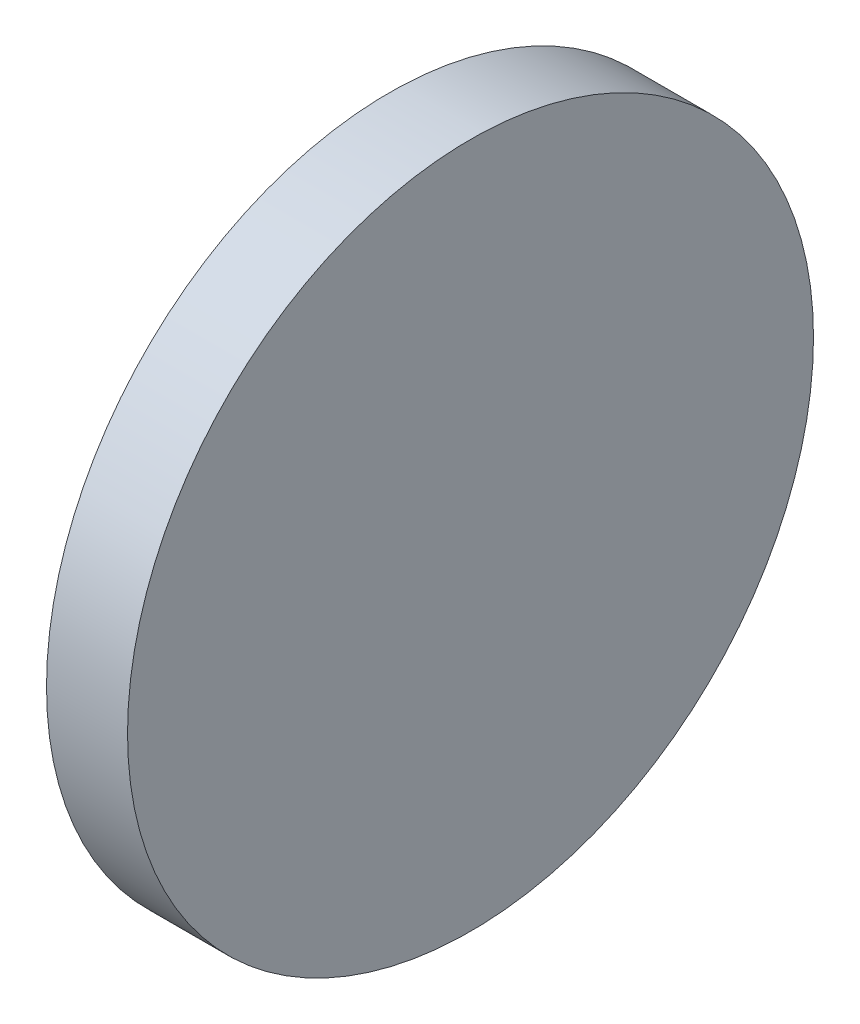
ISO-10303-21;
HEADER;
FILE_DESCRIPTION(('STEP AP214'),'2;1');
FILE_NAME('part.step','',(''),(''),'','','');
FILE_SCHEMA(('AUTOMOTIVE_DESIGN { 1 0 10303 214 1 1 1 1 }'));
ENDSEC;
DATA;
#1=APPLICATION_CONTEXT('core data for automotive mechanical design processes');
#2=APPLICATION_PROTOCOL_DEFINITION('international standard','automotive_design',2000,#1);
#3=PRODUCT_CONTEXT('',#1,'mechanical');
#4=PRODUCT('Part','Part','',(#3));
#5=PRODUCT_RELATED_PRODUCT_CATEGORY('part','',(#4));
#6=PRODUCT_DEFINITION_FORMATION('','',#4);
#7=PRODUCT_DEFINITION_CONTEXT('part definition',#1,'design');
#8=PRODUCT_DEFINITION('design','',#6,#7);
#9=PRODUCT_DEFINITION_SHAPE('','',#8);
#10=(LENGTH_UNIT() NAMED_UNIT(*) SI_UNIT(.MILLI.,.METRE.));
#11=(NAMED_UNIT(*) PLANE_ANGLE_UNIT() SI_UNIT($,.RADIAN.));
#12=(NAMED_UNIT(*) SI_UNIT($,.STERADIAN.) SOLID_ANGLE_UNIT());
#13=UNCERTAINTY_MEASURE_WITH_UNIT(LENGTH_MEASURE(1.E-05),#10,'distance_accuracy_value','');
#14=(GEOMETRIC_REPRESENTATION_CONTEXT(3) GLOBAL_UNCERTAINTY_ASSIGNED_CONTEXT((#13)) GLOBAL_UNIT_ASSIGNED_CONTEXT((#10,
#11,#12)) REPRESENTATION_CONTEXT('',''));
#15=CARTESIAN_POINT('',(0.,0.,0.));
#16=DIRECTION('',(0.,0.,1.));
#17=DIRECTION('',(1.,0.,0.));
#18=AXIS2_PLACEMENT_3D('',#15,#16,#17);
#19=CARTESIAN_POINT('',(-3.,0.,0.));
#20=DIRECTION('',(-1.,0.,0.));
#21=DIRECTION('',(0.,0.,1.));
#22=AXIS2_PLACEMENT_3D('',#19,#20,#21);
#23=CYLINDRICAL_SURFACE('',#22,25.4);
#24=CARTESIAN_POINT('',(-3.,0.,0.));
#25=DIRECTION('',(-1.,0.,0.));
#26=DIRECTION('',(0.,0.,1.));
#27=AXIS2_PLACEMENT_3D('',#24,#25,#26);
#28=CIRCLE('',#27,25.4);
#29=CARTESIAN_POINT('',(-3.,0.,25.4));
#30=VERTEX_POINT('',#29);
#31=EDGE_CURVE('E39',#30,#30,#28,.T.);
#32=ORIENTED_EDGE('',*,*,#31,.F.);
#33=EDGE_LOOP('',(#32));
#34=FACE_BOUND('',#33,.T.);
#35=CARTESIAN_POINT('',(3.,0.,0.));
#36=DIRECTION('',(-1.,0.,0.));
#37=DIRECTION('',(0.,0.,1.));
#38=AXIS2_PLACEMENT_3D('',#35,#36,#37);
#39=CIRCLE('',#38,25.4);
#40=CARTESIAN_POINT('',(3.,0.,25.4));
#41=VERTEX_POINT('',#40);
#42=EDGE_CURVE('E10',#41,#41,#39,.T.);
#43=ORIENTED_EDGE('',*,*,#42,.T.);
#44=EDGE_LOOP('',(#43));
#45=FACE_BOUND('',#44,.T.);
#46=ADVANCED_FACE('F33',(#34,#45),#23,.T.);
#47=CARTESIAN_POINT('',(3.,25.4,0.));
#48=DIRECTION('',(-1.,0.,0.));
#49=DIRECTION('',(0.,0.,1.));
#50=AXIS2_PLACEMENT_3D('',#47,#48,#49);
#51=PLANE('',#50);
#52=ORIENTED_EDGE('',*,*,#42,.F.);
#53=EDGE_LOOP('',(#52));
#54=FACE_BOUND('',#53,.T.);
#55=ADVANCED_FACE('F48',(#54),#51,.F.);
#56=CARTESIAN_POINT('',(-3.,25.4,0.));
#57=DIRECTION('',(1.,0.,0.));
#58=DIRECTION('',(0.,0.,-1.));
#59=AXIS2_PLACEMENT_3D('',#56,#57,#58);
#60=PLANE('',#59);
#61=ORIENTED_EDGE('',*,*,#31,.T.);
#62=EDGE_LOOP('',(#61));
#63=FACE_BOUND('',#62,.T.);
#64=ADVANCED_FACE('F45',(#63),#60,.F.);
#65=CLOSED_SHELL('',(#46,#55,#64));
#66=MANIFOLD_SOLID_BREP('B2',#65);
#67=ADVANCED_BREP_SHAPE_REPRESENTATION('',(#18,#66),#14);
#68=SHAPE_DEFINITION_REPRESENTATION(#9,#67);
ENDSEC;
END-ISO-10303-21;
